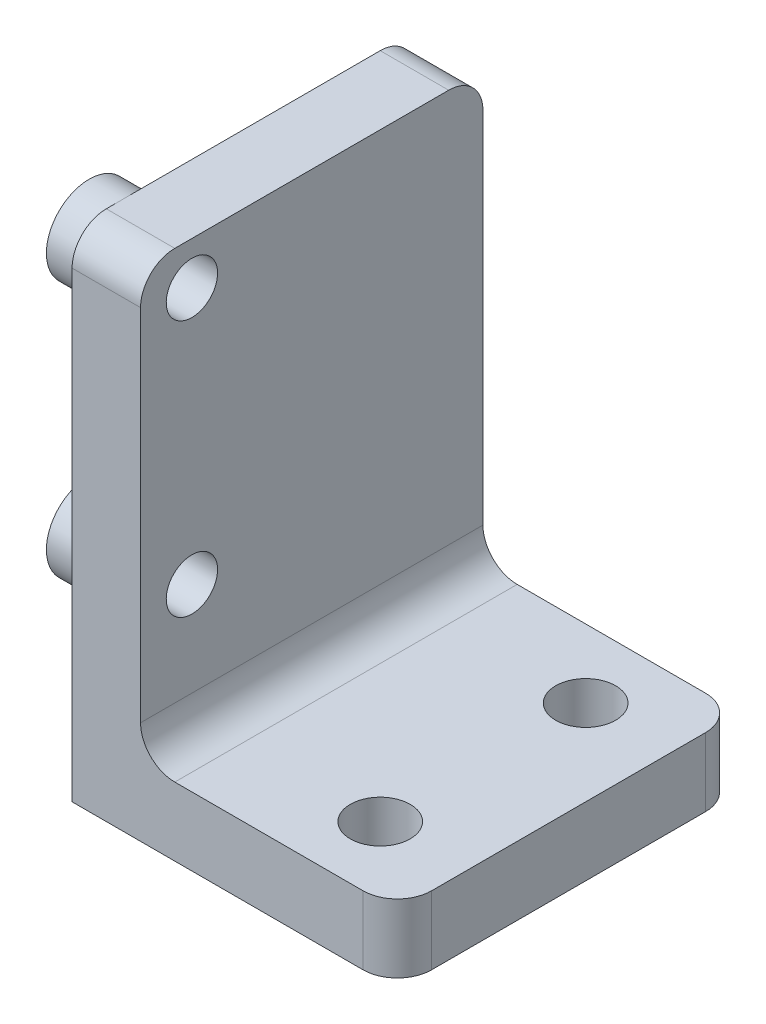
ISO-10303-21;
HEADER;
FILE_DESCRIPTION(('STEP AP214'),'2;1');
FILE_NAME('part.step','',(''),(''),'','','');
FILE_SCHEMA(('AUTOMOTIVE_DESIGN { 1 0 10303 214 1 1 1 1 }'));
ENDSEC;
DATA;
#1=APPLICATION_CONTEXT('core data for automotive mechanical design processes');
#2=APPLICATION_PROTOCOL_DEFINITION('international standard','automotive_design',2000,#1);
#3=PRODUCT_CONTEXT('',#1,'mechanical');
#4=PRODUCT('Part','Part','',(#3));
#5=PRODUCT_RELATED_PRODUCT_CATEGORY('part','',(#4));
#6=PRODUCT_DEFINITION_FORMATION('','',#4);
#7=PRODUCT_DEFINITION_CONTEXT('part definition',#1,'design');
#8=PRODUCT_DEFINITION('design','',#6,#7);
#9=PRODUCT_DEFINITION_SHAPE('','',#8);
#10=(LENGTH_UNIT() NAMED_UNIT(*) SI_UNIT(.MILLI.,.METRE.));
#11=(NAMED_UNIT(*) PLANE_ANGLE_UNIT() SI_UNIT($,.RADIAN.));
#12=(NAMED_UNIT(*) SI_UNIT($,.STERADIAN.) SOLID_ANGLE_UNIT());
#13=UNCERTAINTY_MEASURE_WITH_UNIT(LENGTH_MEASURE(1.E-05),#10,'distance_accuracy_value','');
#14=(GEOMETRIC_REPRESENTATION_CONTEXT(3) GLOBAL_UNCERTAINTY_ASSIGNED_CONTEXT((#13)) GLOBAL_UNIT_ASSIGNED_CONTEXT((#10,
#11,#12)) REPRESENTATION_CONTEXT('',''));
#15=CARTESIAN_POINT('',(0.,0.,0.));
#16=DIRECTION('',(0.,0.,1.));
#17=DIRECTION('',(1.,0.,0.));
#18=AXIS2_PLACEMENT_3D('',#15,#16,#17);
#19=CARTESIAN_POINT('',(19.,0.,20.));
#20=DIRECTION('',(0.,1.,0.));
#21=DIRECTION('',(-1.,0.,0.));
#22=AXIS2_PLACEMENT_3D('',#19,#20,#21);
#23=PLANE('',#22);
#24=CARTESIAN_POINT('',(14.,0.,4.));
#25=DIRECTION('',(0.,1.,0.));
#26=DIRECTION('',(-1.,0.,0.));
#27=AXIS2_PLACEMENT_3D('',#24,#25,#26);
#28=CIRCLE('',#27,1.75);
#29=CARTESIAN_POINT('',(12.25,0.,4.));
#30=VERTEX_POINT('',#29);
#31=EDGE_CURVE('E341',#30,#30,#28,.T.);
#32=ORIENTED_EDGE('',*,*,#31,.T.);
#33=EDGE_LOOP('',(#32));
#34=FACE_BOUND('',#33,.T.);
#35=CARTESIAN_POINT('',(14.,0.,16.));
#36=DIRECTION('',(0.,1.,0.));
#37=DIRECTION('',(-1.,0.,0.));
#38=AXIS2_PLACEMENT_3D('',#35,#36,#37);
#39=CIRCLE('',#38,1.75);
#40=CARTESIAN_POINT('',(12.25,0.,16.));
#41=VERTEX_POINT('',#40);
#42=EDGE_CURVE('E339',#41,#41,#39,.T.);
#43=ORIENTED_EDGE('',*,*,#42,.T.);
#44=EDGE_LOOP('',(#43));
#45=FACE_BOUND('',#44,.T.);
#46=DIRECTION('',(1.,0.,0.));
#47=VECTOR('',#46,1.);
#48=CARTESIAN_POINT('',(19.,0.,0.));
#49=LINE('',#48,#47);
#50=CARTESIAN_POINT('',(0.,0.,0.));
#51=VERTEX_POINT('',#50);
#52=CARTESIAN_POINT('',(17.,0.,0.));
#53=VERTEX_POINT('',#52);
#54=EDGE_CURVE('E162',#51,#53,#49,.T.);
#55=ORIENTED_EDGE('',*,*,#54,.T.);
#56=CARTESIAN_POINT('',(17.,0.,2.));
#57=DIRECTION('',(0.,1.,0.));
#58=DIRECTION('',(-1.,0.,0.));
#59=AXIS2_PLACEMENT_3D('',#56,#57,#58);
#60=CIRCLE('',#59,2.);
#61=CARTESIAN_POINT('',(19.,0.,2.));
#62=VERTEX_POINT('',#61);
#63=EDGE_CURVE('E196',#53,#62,#60,.F.);
#64=ORIENTED_EDGE('',*,*,#63,.T.);
#65=DIRECTION('',(0.,0.,-1.));
#66=VECTOR('',#65,1.);
#67=CARTESIAN_POINT('',(19.,0.,20.));
#68=LINE('',#67,#66);
#69=CARTESIAN_POINT('',(19.,0.,18.));
#70=VERTEX_POINT('',#69);
#71=EDGE_CURVE('E177',#70,#62,#68,.T.);
#72=ORIENTED_EDGE('',*,*,#71,.F.);
#73=CARTESIAN_POINT('',(17.,0.,18.));
#74=DIRECTION('',(0.,1.,0.));
#75=DIRECTION('',(-1.,0.,0.));
#76=AXIS2_PLACEMENT_3D('',#73,#74,#75);
#77=CIRCLE('',#76,2.);
#78=CARTESIAN_POINT('',(17.,0.,20.));
#79=VERTEX_POINT('',#78);
#80=EDGE_CURVE('E150',#70,#79,#77,.F.);
#81=ORIENTED_EDGE('',*,*,#80,.T.);
#82=DIRECTION('',(1.,0.,0.));
#83=VECTOR('',#82,1.);
#84=CARTESIAN_POINT('',(19.,0.,20.));
#85=LINE('',#84,#83);
#86=CARTESIAN_POINT('',(0.,0.,20.));
#87=VERTEX_POINT('',#86);
#88=EDGE_CURVE('E131',#87,#79,#85,.T.);
#89=ORIENTED_EDGE('',*,*,#88,.F.);
#90=DIRECTION('',(0.,0.,-1.));
#91=VECTOR('',#90,1.);
#92=CARTESIAN_POINT('',(0.,0.,20.));
#93=LINE('',#92,#91);
#94=EDGE_CURVE('E136',#87,#51,#93,.T.);
#95=ORIENTED_EDGE('',*,*,#94,.T.);
#96=EDGE_LOOP('',(#55,#64,#72,#81,#89,#95));
#97=FACE_BOUND('',#96,.T.);
#98=ADVANCED_FACE('F41',(#34,#45,#97),#23,.F.);
#99=CARTESIAN_POINT('',(19.,4.,20.));
#100=DIRECTION('',(-1.,0.,0.));
#101=DIRECTION('',(0.,0.,1.));
#102=AXIS2_PLACEMENT_3D('',#99,#100,#101);
#103=PLANE('',#102);
#104=ORIENTED_EDGE('',*,*,#71,.T.);
#105=DIRECTION('',(0.,1.,0.));
#106=VECTOR('',#105,1.);
#107=CARTESIAN_POINT('',(19.,4.,2.));
#108=LINE('',#107,#106);
#109=CARTESIAN_POINT('',(19.,4.,2.));
#110=VERTEX_POINT('',#109);
#111=EDGE_CURVE('E182',#62,#110,#108,.T.);
#112=ORIENTED_EDGE('',*,*,#111,.T.);
#113=DIRECTION('',(0.,0.,-1.));
#114=VECTOR('',#113,1.);
#115=CARTESIAN_POINT('',(19.,4.,20.));
#116=LINE('',#115,#114);
#117=CARTESIAN_POINT('',(19.,4.,18.));
#118=VERTEX_POINT('',#117);
#119=EDGE_CURVE('E174',#118,#110,#116,.T.);
#120=ORIENTED_EDGE('',*,*,#119,.F.);
#121=DIRECTION('',(0.,1.,0.));
#122=VECTOR('',#121,1.);
#123=CARTESIAN_POINT('',(19.,4.,18.));
#124=LINE('',#123,#122);
#125=EDGE_CURVE('E180',#118,#70,#124,.F.);
#126=ORIENTED_EDGE('',*,*,#125,.T.);
#127=EDGE_LOOP('',(#104,#112,#120,#126));
#128=FACE_BOUND('',#127,.T.);
#129=ADVANCED_FACE('F250',(#128),#103,.F.);
#130=CARTESIAN_POINT('',(4.,4.,20.));
#131=DIRECTION('',(0.,-1.,0.));
#132=DIRECTION('',(1.,0.,0.));
#133=AXIS2_PLACEMENT_3D('',#130,#131,#132);
#134=PLANE('',#133);
#135=CARTESIAN_POINT('',(14.,4.,4.));
#136=DIRECTION('',(0.,1.,0.));
#137=DIRECTION('',(-1.,0.,0.));
#138=AXIS2_PLACEMENT_3D('',#135,#136,#137);
#139=CIRCLE('',#138,1.75);
#140=CARTESIAN_POINT('',(12.25,4.,4.));
#141=VERTEX_POINT('',#140);
#142=EDGE_CURVE('E344',#141,#141,#139,.T.);
#143=ORIENTED_EDGE('',*,*,#142,.F.);
#144=EDGE_LOOP('',(#143));
#145=FACE_BOUND('',#144,.T.);
#146=CARTESIAN_POINT('',(14.,4.,16.));
#147=DIRECTION('',(0.,1.,0.));
#148=DIRECTION('',(-1.,0.,0.));
#149=AXIS2_PLACEMENT_3D('',#146,#147,#148);
#150=CIRCLE('',#149,1.75);
#151=CARTESIAN_POINT('',(12.25,4.,16.));
#152=VERTEX_POINT('',#151);
#153=EDGE_CURVE('E347',#152,#152,#150,.T.);
#154=ORIENTED_EDGE('',*,*,#153,.F.);
#155=EDGE_LOOP('',(#154));
#156=FACE_BOUND('',#155,.T.);
#157=ORIENTED_EDGE('',*,*,#119,.T.);
#158=CARTESIAN_POINT('',(17.,4.,2.));
#159=DIRECTION('',(0.,-1.,0.));
#160=DIRECTION('',(1.,0.,0.));
#161=AXIS2_PLACEMENT_3D('',#158,#159,#160);
#162=CIRCLE('',#161,2.);
#163=CARTESIAN_POINT('',(17.,4.,0.));
#164=VERTEX_POINT('',#163);
#165=EDGE_CURVE('E189',#110,#164,#162,.F.);
#166=ORIENTED_EDGE('',*,*,#165,.T.);
#167=DIRECTION('',(-1.,0.,0.));
#168=VECTOR('',#167,1.);
#169=CARTESIAN_POINT('',(4.,4.,0.));
#170=LINE('',#169,#168);
#171=CARTESIAN_POINT('',(6.,4.,0.));
#172=VERTEX_POINT('',#171);
#173=EDGE_CURVE('E164',#164,#172,#170,.T.);
#174=ORIENTED_EDGE('',*,*,#173,.T.);
#175=DIRECTION('',(0.,0.,-1.));
#176=VECTOR('',#175,1.);
#177=CARTESIAN_POINT('',(6.,4.,20.));
#178=LINE('',#177,#176);
#179=CARTESIAN_POINT('',(6.,4.,20.));
#180=VERTEX_POINT('',#179);
#181=EDGE_CURVE('E185',#172,#180,#178,.F.);
#182=ORIENTED_EDGE('',*,*,#181,.T.);
#183=DIRECTION('',(-1.,0.,0.));
#184=VECTOR('',#183,1.);
#185=CARTESIAN_POINT('',(4.,4.,20.));
#186=LINE('',#185,#184);
#187=CARTESIAN_POINT('',(17.,4.,20.));
#188=VERTEX_POINT('',#187);
#189=EDGE_CURVE('E151',#188,#180,#186,.T.);
#190=ORIENTED_EDGE('',*,*,#189,.F.);
#191=CARTESIAN_POINT('',(17.,4.,18.));
#192=DIRECTION('',(0.,-1.,0.));
#193=DIRECTION('',(1.,0.,0.));
#194=AXIS2_PLACEMENT_3D('',#191,#192,#193);
#195=CIRCLE('',#194,2.);
#196=EDGE_CURVE('E187',#188,#118,#195,.F.);
#197=ORIENTED_EDGE('',*,*,#196,.T.);
#198=EDGE_LOOP('',(#157,#166,#174,#182,#190,#197));
#199=FACE_BOUND('',#198,.T.);
#200=ADVANCED_FACE('F225',(#145,#156,#199),#134,.F.);
#201=CARTESIAN_POINT('',(3.99999999999999,29.,20.));
#202=DIRECTION('',(-1.,0.,0.));
#203=DIRECTION('',(0.,-1.,0.));
#204=AXIS2_PLACEMENT_3D('',#201,#202,#203);
#205=PLANE('',#204);
#206=CARTESIAN_POINT('',(3.99999999999999,26.5,17.));
#207=DIRECTION('',(-1.,0.,0.));
#208=DIRECTION('',(0.,-1.,0.));
#209=AXIS2_PLACEMENT_3D('',#206,#207,#208);
#210=CIRCLE('',#209,1.5);
#211=CARTESIAN_POINT('',(3.99999999999999,25.,17.));
#212=VERTEX_POINT('',#211);
#213=EDGE_CURVE('E158',#212,#212,#210,.T.);
#214=ORIENTED_EDGE('',*,*,#213,.T.);
#215=EDGE_LOOP('',(#214));
#216=FACE_BOUND('',#215,.T.);
#217=CARTESIAN_POINT('',(4.,11.5,17.));
#218=DIRECTION('',(-1.,0.,0.));
#219=DIRECTION('',(0.,-1.,0.));
#220=AXIS2_PLACEMENT_3D('',#217,#218,#219);
#221=CIRCLE('',#220,1.5);
#222=CARTESIAN_POINT('',(4.,10.,17.));
#223=VERTEX_POINT('',#222);
#224=EDGE_CURVE('E343',#223,#223,#221,.T.);
#225=ORIENTED_EDGE('',*,*,#224,.T.);
#226=EDGE_LOOP('',(#225));
#227=FACE_BOUND('',#226,.T.);
#228=DIRECTION('',(0.,1.,0.));
#229=VECTOR('',#228,1.);
#230=CARTESIAN_POINT('',(3.99999999999999,29.,20.));
#231=LINE('',#230,#229);
#232=CARTESIAN_POINT('',(4.,6.,20.));
#233=VERTEX_POINT('',#232);
#234=CARTESIAN_POINT('',(3.99999999999999,27.,20.));
#235=VERTEX_POINT('',#234);
#236=EDGE_CURVE('E137',#233,#235,#231,.T.);
#237=ORIENTED_EDGE('',*,*,#236,.F.);
#238=DIRECTION('',(0.,0.,-1.));
#239=VECTOR('',#238,1.);
#240=CARTESIAN_POINT('',(4.,6.,0.));
#241=LINE('',#240,#239);
#242=CARTESIAN_POINT('',(4.,6.,0.));
#243=VERTEX_POINT('',#242);
#244=EDGE_CURVE('E205',#233,#243,#241,.T.);
#245=ORIENTED_EDGE('',*,*,#244,.T.);
#246=DIRECTION('',(0.,1.,0.));
#247=VECTOR('',#246,1.);
#248=CARTESIAN_POINT('',(3.99999999999999,29.,0.));
#249=LINE('',#248,#247);
#250=CARTESIAN_POINT('',(3.99999999999999,27.,0.));
#251=VERTEX_POINT('',#250);
#252=EDGE_CURVE('E155',#243,#251,#249,.T.);
#253=ORIENTED_EDGE('',*,*,#252,.T.);
#254=CARTESIAN_POINT('',(3.99999999999999,27.,2.));
#255=DIRECTION('',(-1.,0.,0.));
#256=DIRECTION('',(0.,-1.,0.));
#257=AXIS2_PLACEMENT_3D('',#254,#255,#256);
#258=CIRCLE('',#257,2.);
#259=CARTESIAN_POINT('',(3.99999999999999,29.,2.));
#260=VERTEX_POINT('',#259);
#261=EDGE_CURVE('E203',#251,#260,#258,.F.);
#262=ORIENTED_EDGE('',*,*,#261,.T.);
#263=DIRECTION('',(0.,0.,-1.));
#264=VECTOR('',#263,1.);
#265=CARTESIAN_POINT('',(3.99999999999999,29.,20.));
#266=LINE('',#265,#264);
#267=CARTESIAN_POINT('',(3.99999999999999,29.,18.));
#268=VERTEX_POINT('',#267);
#269=EDGE_CURVE('E171',#268,#260,#266,.T.);
#270=ORIENTED_EDGE('',*,*,#269,.F.);
#271=CARTESIAN_POINT('',(3.99999999999999,27.,18.));
#272=DIRECTION('',(-1.,0.,0.));
#273=DIRECTION('',(0.,-1.,0.));
#274=AXIS2_PLACEMENT_3D('',#271,#272,#273);
#275=CIRCLE('',#274,2.);
#276=EDGE_CURVE('E201',#268,#235,#275,.F.);
#277=ORIENTED_EDGE('',*,*,#276,.T.);
#278=EDGE_LOOP('',(#237,#245,#253,#262,#270,#277));
#279=FACE_BOUND('',#278,.T.);
#280=ADVANCED_FACE('F231',(#216,#227,#279),#205,.F.);
#281=CARTESIAN_POINT('',(0.,29.,20.));
#282=DIRECTION('',(0.,-1.,0.));
#283=DIRECTION('',(0.,0.,-1.));
#284=AXIS2_PLACEMENT_3D('',#281,#282,#283);
#285=PLANE('',#284);
#286=ORIENTED_EDGE('',*,*,#269,.T.);
#287=DIRECTION('',(-1.,0.,0.));
#288=VECTOR('',#287,1.);
#289=CARTESIAN_POINT('',(0.,29.,2.));
#290=LINE('',#289,#288);
#291=CARTESIAN_POINT('',(0.,29.,2.));
#292=VERTEX_POINT('',#291);
#293=EDGE_CURVE('E210',#260,#292,#290,.T.);
#294=ORIENTED_EDGE('',*,*,#293,.T.);
#295=DIRECTION('',(0.,0.,-1.));
#296=VECTOR('',#295,1.);
#297=CARTESIAN_POINT('',(0.,29.,20.));
#298=LINE('',#297,#296);
#299=CARTESIAN_POINT('',(0.,29.,17.));
#300=VERTEX_POINT('',#299);
#301=EDGE_CURVE('E60',#300,#292,#298,.T.);
#302=ORIENTED_EDGE('',*,*,#301,.F.);
#303=CARTESIAN_POINT('',(0.,29.,18.));
#304=VERTEX_POINT('',#303);
#305=EDGE_CURVE('E169',#304,#300,#298,.T.);
#306=ORIENTED_EDGE('',*,*,#305,.F.);
#307=DIRECTION('',(-1.,0.,0.));
#308=VECTOR('',#307,1.);
#309=CARTESIAN_POINT('',(0.,29.,18.));
#310=LINE('',#309,#308);
#311=EDGE_CURVE('E208',#304,#268,#310,.F.);
#312=ORIENTED_EDGE('',*,*,#311,.T.);
#313=EDGE_LOOP('',(#286,#294,#302,#306,#312));
#314=FACE_BOUND('',#313,.T.);
#315=ADVANCED_FACE('F238',(#314),#285,.F.);
#316=CARTESIAN_POINT('',(0.,0.,20.));
#317=DIRECTION('',(1.,0.,0.));
#318=DIRECTION('',(0.,1.,0.));
#319=AXIS2_PLACEMENT_3D('',#316,#317,#318);
#320=PLANE('',#319);
#321=CARTESIAN_POINT('',(0.,11.5,17.));
#322=DIRECTION('',(1.,0.,0.));
#323=DIRECTION('',(0.,1.,0.));
#324=AXIS2_PLACEMENT_3D('',#321,#322,#323);
#325=CIRCLE('',#324,2.5);
#326=CARTESIAN_POINT('',(0.,14.,17.));
#327=VERTEX_POINT('',#326);
#328=EDGE_CURVE('E326',#327,#327,#325,.T.);
#329=ORIENTED_EDGE('',*,*,#328,.T.);
#330=EDGE_LOOP('',(#329));
#331=FACE_BOUND('',#330,.T.);
#332=ORIENTED_EDGE('',*,*,#305,.T.);
#333=CARTESIAN_POINT('',(0.,26.5,17.));
#334=DIRECTION('',(1.,0.,0.));
#335=DIRECTION('',(0.,1.,0.));
#336=AXIS2_PLACEMENT_3D('',#333,#334,#335);
#337=CIRCLE('',#336,2.5);
#338=EDGE_CURVE('E54',#300,#300,#337,.T.);
#339=ORIENTED_EDGE('',*,*,#338,.T.);
#340=ORIENTED_EDGE('',*,*,#301,.T.);
#341=CARTESIAN_POINT('',(0.,27.,2.));
#342=DIRECTION('',(1.,0.,0.));
#343=DIRECTION('',(0.,1.,0.));
#344=AXIS2_PLACEMENT_3D('',#341,#342,#343);
#345=CIRCLE('',#344,2.);
#346=CARTESIAN_POINT('',(0.,27.,0.));
#347=VERTEX_POINT('',#346);
#348=EDGE_CURVE('E215',#292,#347,#345,.F.);
#349=ORIENTED_EDGE('',*,*,#348,.T.);
#350=DIRECTION('',(0.,-1.,0.));
#351=VECTOR('',#350,1.);
#352=CARTESIAN_POINT('',(0.,0.,0.));
#353=LINE('',#352,#351);
#354=EDGE_CURVE('E143',#347,#51,#353,.T.);
#355=ORIENTED_EDGE('',*,*,#354,.T.);
#356=ORIENTED_EDGE('',*,*,#94,.F.);
#357=DIRECTION('',(0.,-1.,0.));
#358=VECTOR('',#357,1.);
#359=CARTESIAN_POINT('',(0.,0.,20.));
#360=LINE('',#359,#358);
#361=CARTESIAN_POINT('',(0.,27.,20.));
#362=VERTEX_POINT('',#361);
#363=EDGE_CURVE('E126',#362,#87,#360,.T.);
#364=ORIENTED_EDGE('',*,*,#363,.F.);
#365=CARTESIAN_POINT('',(0.,27.,18.));
#366=DIRECTION('',(1.,0.,0.));
#367=DIRECTION('',(0.,1.,0.));
#368=AXIS2_PLACEMENT_3D('',#365,#366,#367);
#369=CIRCLE('',#368,2.);
#370=EDGE_CURVE('E213',#362,#304,#369,.F.);
#371=ORIENTED_EDGE('',*,*,#370,.T.);
#372=EDGE_LOOP('',(#332,#339,#340,#349,#355,#356,#364,#371));
#373=FACE_BOUND('',#372,.T.);
#374=ADVANCED_FACE('F141',(#331,#373),#320,.F.);
#375=CARTESIAN_POINT('',(0.,0.,20.));
#376=DIRECTION('',(0.,0.,-1.));
#377=DIRECTION('',(-1.,0.,0.));
#378=AXIS2_PLACEMENT_3D('',#375,#376,#377);
#379=PLANE('',#378);
#380=ORIENTED_EDGE('',*,*,#88,.T.);
#381=DIRECTION('',(0.,1.,0.));
#382=VECTOR('',#381,1.);
#383=CARTESIAN_POINT('',(17.,0.,20.));
#384=LINE('',#383,#382);
#385=EDGE_CURVE('E199',#79,#188,#384,.T.);
#386=ORIENTED_EDGE('',*,*,#385,.T.);
#387=ORIENTED_EDGE('',*,*,#189,.T.);
#388=CARTESIAN_POINT('',(6.,6.,20.));
#389=DIRECTION('',(0.,0.,-1.));
#390=DIRECTION('',(-1.,0.,0.));
#391=AXIS2_PLACEMENT_3D('',#388,#389,#390);
#392=CIRCLE('',#391,2.);
#393=EDGE_CURVE('E11',#180,#233,#392,.T.);
#394=ORIENTED_EDGE('',*,*,#393,.T.);
#395=ORIENTED_EDGE('',*,*,#236,.T.);
#396=DIRECTION('',(-1.,0.,0.));
#397=VECTOR('',#396,1.);
#398=CARTESIAN_POINT('',(0.,27.,20.));
#399=LINE('',#398,#397);
#400=EDGE_CURVE('E135',#235,#362,#399,.T.);
#401=ORIENTED_EDGE('',*,*,#400,.T.);
#402=ORIENTED_EDGE('',*,*,#363,.T.);
#403=EDGE_LOOP('',(#380,#386,#387,#394,#395,#401,#402));
#404=FACE_BOUND('',#403,.T.);
#405=ADVANCED_FACE('F128',(#404),#379,.F.);
#406=CARTESIAN_POINT('',(0.,0.,0.));
#407=DIRECTION('',(0.,0.,-1.));
#408=DIRECTION('',(-1.,0.,0.));
#409=AXIS2_PLACEMENT_3D('',#406,#407,#408);
#410=PLANE('',#409);
#411=ORIENTED_EDGE('',*,*,#173,.F.);
#412=DIRECTION('',(0.,1.,0.));
#413=VECTOR('',#412,1.);
#414=CARTESIAN_POINT('',(17.,0.,0.));
#415=LINE('',#414,#413);
#416=EDGE_CURVE('E193',#164,#53,#415,.F.);
#417=ORIENTED_EDGE('',*,*,#416,.T.);
#418=ORIENTED_EDGE('',*,*,#54,.F.);
#419=ORIENTED_EDGE('',*,*,#354,.F.);
#420=DIRECTION('',(-1.,0.,0.));
#421=VECTOR('',#420,1.);
#422=CARTESIAN_POINT('',(3.99999999999999,27.,0.));
#423=LINE('',#422,#421);
#424=EDGE_CURVE('E191',#347,#251,#423,.F.);
#425=ORIENTED_EDGE('',*,*,#424,.T.);
#426=ORIENTED_EDGE('',*,*,#252,.F.);
#427=CARTESIAN_POINT('',(6.,6.,0.));
#428=DIRECTION('',(0.,0.,-1.));
#429=DIRECTION('',(-1.,0.,0.));
#430=AXIS2_PLACEMENT_3D('',#427,#428,#429);
#431=CIRCLE('',#430,2.);
#432=EDGE_CURVE('E49',#243,#172,#431,.F.);
#433=ORIENTED_EDGE('',*,*,#432,.T.);
#434=EDGE_LOOP('',(#411,#417,#418,#419,#425,#426,#433));
#435=FACE_BOUND('',#434,.T.);
#436=ADVANCED_FACE('F219',(#435),#410,.T.);
#437=CARTESIAN_POINT('',(19.,11.5,17.));
#438=DIRECTION('',(-1.,0.,0.));
#439=DIRECTION('',(0.,-1.,0.));
#440=AXIS2_PLACEMENT_3D('',#437,#438,#439);
#441=CYLINDRICAL_SURFACE('',#440,1.5);
#442=ORIENTED_EDGE('',*,*,#224,.F.);
#443=EDGE_LOOP('',(#442));
#444=FACE_BOUND('',#443,.T.);
#445=CARTESIAN_POINT('',(-2.,11.5,17.));
#446=DIRECTION('',(1.,0.,0.));
#447=DIRECTION('',(0.,1.,0.));
#448=AXIS2_PLACEMENT_3D('',#445,#446,#447);
#449=CIRCLE('',#448,1.5);
#450=CARTESIAN_POINT('',(-2.,13.,17.));
#451=VERTEX_POINT('',#450);
#452=EDGE_CURVE('E327',#451,#451,#449,.T.);
#453=ORIENTED_EDGE('',*,*,#452,.F.);
#454=EDGE_LOOP('',(#453));
#455=FACE_BOUND('',#454,.T.);
#456=ADVANCED_FACE('F287',(#444,#455),#441,.F.);
#457=CARTESIAN_POINT('',(19.,26.5,17.));
#458=DIRECTION('',(-1.,0.,0.));
#459=DIRECTION('',(0.,-1.,0.));
#460=AXIS2_PLACEMENT_3D('',#457,#458,#459);
#461=CYLINDRICAL_SURFACE('',#460,1.5);
#462=ORIENTED_EDGE('',*,*,#213,.F.);
#463=EDGE_LOOP('',(#462));
#464=FACE_BOUND('',#463,.T.);
#465=CARTESIAN_POINT('',(-2.00000000000001,26.5,17.));
#466=DIRECTION('',(1.,0.,0.));
#467=DIRECTION('',(0.,1.,0.));
#468=AXIS2_PLACEMENT_3D('',#465,#466,#467);
#469=CIRCLE('',#468,1.5);
#470=CARTESIAN_POINT('',(-2.00000000000001,28.,17.));
#471=VERTEX_POINT('',#470);
#472=EDGE_CURVE('E330',#471,#471,#469,.T.);
#473=ORIENTED_EDGE('',*,*,#472,.F.);
#474=EDGE_LOOP('',(#473));
#475=FACE_BOUND('',#474,.T.);
#476=ADVANCED_FACE('F292',(#464,#475),#461,.F.);
#477=CARTESIAN_POINT('',(14.,0.,16.));
#478=DIRECTION('',(0.,1.,0.));
#479=DIRECTION('',(-1.,0.,0.));
#480=AXIS2_PLACEMENT_3D('',#477,#478,#479);
#481=CYLINDRICAL_SURFACE('',#480,1.75);
#482=ORIENTED_EDGE('',*,*,#42,.F.);
#483=EDGE_LOOP('',(#482));
#484=FACE_BOUND('',#483,.T.);
#485=ORIENTED_EDGE('',*,*,#153,.T.);
#486=EDGE_LOOP('',(#485));
#487=FACE_BOUND('',#486,.T.);
#488=ADVANCED_FACE('F296',(#484,#487),#481,.F.);
#489=CARTESIAN_POINT('',(14.,0.,4.));
#490=DIRECTION('',(0.,1.,0.));
#491=DIRECTION('',(-1.,0.,0.));
#492=AXIS2_PLACEMENT_3D('',#489,#490,#491);
#493=CYLINDRICAL_SURFACE('',#492,1.75);
#494=ORIENTED_EDGE('',*,*,#31,.F.);
#495=EDGE_LOOP('',(#494));
#496=FACE_BOUND('',#495,.T.);
#497=ORIENTED_EDGE('',*,*,#142,.T.);
#498=EDGE_LOOP('',(#497));
#499=FACE_BOUND('',#498,.T.);
#500=ADVANCED_FACE('F261',(#496,#499),#493,.F.);
#501=CARTESIAN_POINT('',(17.,4.,2.));
#502=DIRECTION('',(0.,-1.,0.));
#503=DIRECTION('',(0.,0.,-1.));
#504=AXIS2_PLACEMENT_3D('',#501,#502,#503);
#505=CYLINDRICAL_SURFACE('',#504,2.);
#506=ORIENTED_EDGE('',*,*,#63,.F.);
#507=ORIENTED_EDGE('',*,*,#416,.F.);
#508=ORIENTED_EDGE('',*,*,#165,.F.);
#509=ORIENTED_EDGE('',*,*,#111,.F.);
#510=EDGE_LOOP('',(#506,#507,#508,#509));
#511=FACE_BOUND('',#510,.T.);
#512=ADVANCED_FACE('F247',(#511),#505,.T.);
#513=CARTESIAN_POINT('',(17.,0.,18.));
#514=DIRECTION('',(0.,1.,0.));
#515=DIRECTION('',(0.,0.,1.));
#516=AXIS2_PLACEMENT_3D('',#513,#514,#515);
#517=CYLINDRICAL_SURFACE('',#516,2.);
#518=ORIENTED_EDGE('',*,*,#80,.F.);
#519=ORIENTED_EDGE('',*,*,#125,.F.);
#520=ORIENTED_EDGE('',*,*,#196,.F.);
#521=ORIENTED_EDGE('',*,*,#385,.F.);
#522=EDGE_LOOP('',(#518,#519,#520,#521));
#523=FACE_BOUND('',#522,.T.);
#524=ADVANCED_FACE('F253',(#523),#517,.T.);
#525=CARTESIAN_POINT('',(6.,6.,20.));
#526=DIRECTION('',(0.,0.,1.));
#527=DIRECTION('',(1.,0.,0.));
#528=AXIS2_PLACEMENT_3D('',#525,#526,#527);
#529=CYLINDRICAL_SURFACE('',#528,2.);
#530=ORIENTED_EDGE('',*,*,#393,.F.);
#531=ORIENTED_EDGE('',*,*,#181,.F.);
#532=ORIENTED_EDGE('',*,*,#432,.F.);
#533=ORIENTED_EDGE('',*,*,#244,.F.);
#534=EDGE_LOOP('',(#530,#531,#532,#533));
#535=FACE_BOUND('',#534,.T.);
#536=ADVANCED_FACE('F228',(#535),#529,.F.);
#537=CARTESIAN_POINT('',(0.,27.,2.));
#538=DIRECTION('',(1.,0.,0.));
#539=DIRECTION('',(0.,0.,-1.));
#540=AXIS2_PLACEMENT_3D('',#537,#538,#539);
#541=CYLINDRICAL_SURFACE('',#540,2.);
#542=ORIENTED_EDGE('',*,*,#261,.F.);
#543=ORIENTED_EDGE('',*,*,#424,.F.);
#544=ORIENTED_EDGE('',*,*,#348,.F.);
#545=ORIENTED_EDGE('',*,*,#293,.F.);
#546=EDGE_LOOP('',(#542,#543,#544,#545));
#547=FACE_BOUND('',#546,.T.);
#548=ADVANCED_FACE('F242',(#547),#541,.T.);
#549=CARTESIAN_POINT('',(0.,27.,18.));
#550=DIRECTION('',(-1.,0.,0.));
#551=DIRECTION('',(0.,0.,1.));
#552=AXIS2_PLACEMENT_3D('',#549,#550,#551);
#553=CYLINDRICAL_SURFACE('',#552,2.);
#554=ORIENTED_EDGE('',*,*,#276,.F.);
#555=ORIENTED_EDGE('',*,*,#311,.F.);
#556=ORIENTED_EDGE('',*,*,#370,.F.);
#557=ORIENTED_EDGE('',*,*,#400,.F.);
#558=EDGE_LOOP('',(#554,#555,#556,#557));
#559=FACE_BOUND('',#558,.T.);
#560=ADVANCED_FACE('F43',(#559),#553,.T.);
#561=CARTESIAN_POINT('',(-2.00000000000001,26.5,17.));
#562=DIRECTION('',(1.,0.,0.));
#563=DIRECTION('',(0.,1.,0.));
#564=AXIS2_PLACEMENT_3D('',#561,#562,#563);
#565=CYLINDRICAL_SURFACE('',#564,2.5);
#566=CARTESIAN_POINT('',(-2.00000000000001,26.5,17.));
#567=DIRECTION('',(1.,0.,0.));
#568=DIRECTION('',(0.,1.,0.));
#569=AXIS2_PLACEMENT_3D('',#566,#567,#568);
#570=CIRCLE('',#569,2.5);
#571=CARTESIAN_POINT('',(-2.00000000000001,29.,17.));
#572=VERTEX_POINT('',#571);
#573=EDGE_CURVE('E336',#572,#572,#570,.T.);
#574=ORIENTED_EDGE('',*,*,#573,.T.);
#575=EDGE_LOOP('',(#574));
#576=FACE_BOUND('',#575,.T.);
#577=ORIENTED_EDGE('',*,*,#338,.F.);
#578=EDGE_LOOP('',(#577));
#579=FACE_BOUND('',#578,.T.);
#580=ADVANCED_FACE('F303',(#576,#579),#565,.T.);
#581=CARTESIAN_POINT('',(-2.00000000000001,26.5,17.));
#582=DIRECTION('',(1.,0.,0.));
#583=DIRECTION('',(0.,1.,0.));
#584=AXIS2_PLACEMENT_3D('',#581,#582,#583);
#585=PLANE('',#584);
#586=ORIENTED_EDGE('',*,*,#472,.T.);
#587=EDGE_LOOP('',(#586));
#588=FACE_BOUND('',#587,.T.);
#589=ORIENTED_EDGE('',*,*,#573,.F.);
#590=EDGE_LOOP('',(#589));
#591=FACE_BOUND('',#590,.T.);
#592=ADVANCED_FACE('F306',(#588,#591),#585,.F.);
#593=CARTESIAN_POINT('',(-2.,11.5,17.));
#594=DIRECTION('',(1.,0.,0.));
#595=DIRECTION('',(0.,1.,0.));
#596=AXIS2_PLACEMENT_3D('',#593,#594,#595);
#597=CYLINDRICAL_SURFACE('',#596,2.5);
#598=CARTESIAN_POINT('',(-2.,11.5,17.));
#599=DIRECTION('',(1.,0.,0.));
#600=DIRECTION('',(0.,1.,0.));
#601=AXIS2_PLACEMENT_3D('',#598,#599,#600);
#602=CIRCLE('',#601,2.5);
#603=CARTESIAN_POINT('',(-2.,14.,17.));
#604=VERTEX_POINT('',#603);
#605=EDGE_CURVE('E323',#604,#604,#602,.T.);
#606=ORIENTED_EDGE('',*,*,#605,.T.);
#607=EDGE_LOOP('',(#606));
#608=FACE_BOUND('',#607,.T.);
#609=ORIENTED_EDGE('',*,*,#328,.F.);
#610=EDGE_LOOP('',(#609));
#611=FACE_BOUND('',#610,.T.);
#612=ADVANCED_FACE('F310',(#608,#611),#597,.T.);
#613=CARTESIAN_POINT('',(-2.,11.5,17.));
#614=DIRECTION('',(1.,0.,0.));
#615=DIRECTION('',(0.,1.,0.));
#616=AXIS2_PLACEMENT_3D('',#613,#614,#615);
#617=PLANE('',#616);
#618=ORIENTED_EDGE('',*,*,#452,.T.);
#619=EDGE_LOOP('',(#618));
#620=FACE_BOUND('',#619,.T.);
#621=ORIENTED_EDGE('',*,*,#605,.F.);
#622=EDGE_LOOP('',(#621));
#623=FACE_BOUND('',#622,.T.);
#624=ADVANCED_FACE('F312',(#620,#623),#617,.F.);
#625=CLOSED_SHELL('',(#98,#129,#200,#280,#315,#374,#405,#436,#456,#476,#488,#500,#512,#524,#536,
#548,#560,#580,#592,#612,#624));
#626=MANIFOLD_SOLID_BREP('B2',#625);
#627=ADVANCED_BREP_SHAPE_REPRESENTATION('',(#18,#626),#14);
#628=SHAPE_DEFINITION_REPRESENTATION(#9,#627);
ENDSEC;
END-ISO-10303-21;
